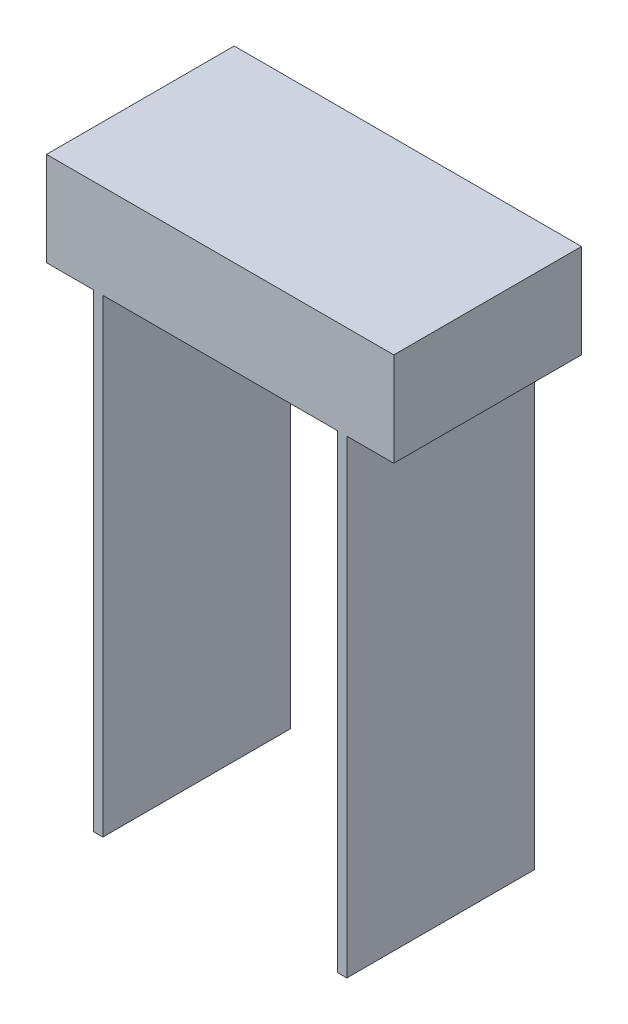
ISO-10303-21;
HEADER;
FILE_DESCRIPTION(('STEP AP214'),'2;1');
FILE_NAME('part.step','',(''),(''),'','','');
FILE_SCHEMA(('AUTOMOTIVE_DESIGN { 1 0 10303 214 1 1 1 1 }'));
ENDSEC;
DATA;
#1=APPLICATION_CONTEXT('core data for automotive mechanical design processes');
#2=APPLICATION_PROTOCOL_DEFINITION('international standard','automotive_design',2000,#1);
#3=PRODUCT_CONTEXT('',#1,'mechanical');
#4=PRODUCT('Part','Part','',(#3));
#5=PRODUCT_RELATED_PRODUCT_CATEGORY('part','',(#4));
#6=PRODUCT_DEFINITION_FORMATION('','',#4);
#7=PRODUCT_DEFINITION_CONTEXT('part definition',#1,'design');
#8=PRODUCT_DEFINITION('design','',#6,#7);
#9=PRODUCT_DEFINITION_SHAPE('','',#8);
#10=(LENGTH_UNIT() NAMED_UNIT(*) SI_UNIT(.MILLI.,.METRE.));
#11=(NAMED_UNIT(*) PLANE_ANGLE_UNIT() SI_UNIT($,.RADIAN.));
#12=(NAMED_UNIT(*) SI_UNIT($,.STERADIAN.) SOLID_ANGLE_UNIT());
#13=UNCERTAINTY_MEASURE_WITH_UNIT(LENGTH_MEASURE(1.E-05),#10,'distance_accuracy_value','');
#14=(GEOMETRIC_REPRESENTATION_CONTEXT(3) GLOBAL_UNCERTAINTY_ASSIGNED_CONTEXT((#13)) GLOBAL_UNIT_ASSIGNED_CONTEXT((#10,
#11,#12)) REPRESENTATION_CONTEXT('',''));
#15=CARTESIAN_POINT('',(0.,0.,0.));
#16=DIRECTION('',(0.,0.,1.));
#17=DIRECTION('',(1.,0.,0.));
#18=AXIS2_PLACEMENT_3D('',#15,#16,#17);
#19=CARTESIAN_POINT('',(-10.6233766233766,12.1298701298701,8.));
#20=DIRECTION('',(1.,0.,0.));
#21=DIRECTION('',(0.,0.,-1.));
#22=AXIS2_PLACEMENT_3D('',#19,#20,#21);
#23=PLANE('',#22);
#24=DIRECTION('',(0.,-1.,0.));
#25=VECTOR('',#24,1.);
#26=CARTESIAN_POINT('',(-10.6233766233766,12.1298701298701,0.));
#27=LINE('',#26,#25);
#28=CARTESIAN_POINT('',(-10.6233766233766,12.1298701298701,0.));
#29=VERTEX_POINT('',#28);
#30=CARTESIAN_POINT('',(-10.6233766233766,-7.87012987012987,0.));
#31=VERTEX_POINT('',#30);
#32=EDGE_CURVE('E156',#29,#31,#27,.T.);
#33=ORIENTED_EDGE('',*,*,#32,.T.);
#34=DIRECTION('',(0.,0.,-1.));
#35=VECTOR('',#34,1.);
#36=CARTESIAN_POINT('',(-10.6233766233766,-7.87012987012987,8.));
#37=LINE('',#36,#35);
#38=CARTESIAN_POINT('',(-10.6233766233766,-7.87012987012987,8.));
#39=VERTEX_POINT('',#38);
#40=EDGE_CURVE('E11',#39,#31,#37,.T.);
#41=ORIENTED_EDGE('',*,*,#40,.F.);
#42=DIRECTION('',(0.,-1.,0.));
#43=VECTOR('',#42,1.);
#44=CARTESIAN_POINT('',(-10.6233766233766,12.1298701298701,8.));
#45=LINE('',#44,#43);
#46=CARTESIAN_POINT('',(-10.6233766233766,12.1298701298701,8.));
#47=VERTEX_POINT('',#46);
#48=EDGE_CURVE('E178',#47,#39,#45,.T.);
#49=ORIENTED_EDGE('',*,*,#48,.F.);
#50=DIRECTION('',(0.,0.,-1.));
#51=VECTOR('',#50,1.);
#52=CARTESIAN_POINT('',(-10.6233766233766,12.1298701298701,8.));
#53=LINE('',#52,#51);
#54=EDGE_CURVE('E152',#47,#29,#53,.T.);
#55=ORIENTED_EDGE('',*,*,#54,.T.);
#56=EDGE_LOOP('',(#33,#41,#49,#55));
#57=FACE_BOUND('',#56,.T.);
#58=ADVANCED_FACE('F36',(#57),#23,.F.);
#59=CARTESIAN_POINT('',(-10.6233766233766,-7.87012987012987,8.));
#60=DIRECTION('',(0.,1.,0.));
#61=DIRECTION('',(0.,0.,1.));
#62=AXIS2_PLACEMENT_3D('',#59,#60,#61);
#63=PLANE('',#62);
#64=DIRECTION('',(1.,0.,0.));
#65=VECTOR('',#64,1.);
#66=CARTESIAN_POINT('',(-10.6233766233766,-7.87012987012987,0.));
#67=LINE('',#66,#65);
#68=CARTESIAN_POINT('',(-10.2233766233766,-7.87012987012987,0.));
#69=VERTEX_POINT('',#68);
#70=EDGE_CURVE('E159',#31,#69,#67,.T.);
#71=ORIENTED_EDGE('',*,*,#70,.T.);
#72=DIRECTION('',(0.,0.,-1.));
#73=VECTOR('',#72,1.);
#74=CARTESIAN_POINT('',(-10.2233766233766,-7.87012987012987,8.));
#75=LINE('',#74,#73);
#76=CARTESIAN_POINT('',(-10.2233766233766,-7.87012987012987,8.));
#77=VERTEX_POINT('',#76);
#78=EDGE_CURVE('E44',#77,#69,#75,.T.);
#79=ORIENTED_EDGE('',*,*,#78,.F.);
#80=DIRECTION('',(1.,0.,0.));
#81=VECTOR('',#80,1.);
#82=CARTESIAN_POINT('',(-10.6233766233766,-7.87012987012987,8.));
#83=LINE('',#82,#81);
#84=EDGE_CURVE('E107',#39,#77,#83,.T.);
#85=ORIENTED_EDGE('',*,*,#84,.F.);
#86=ORIENTED_EDGE('',*,*,#40,.T.);
#87=EDGE_LOOP('',(#71,#79,#85,#86));
#88=FACE_BOUND('',#87,.T.);
#89=ADVANCED_FACE('F256',(#88),#63,.F.);
#90=CARTESIAN_POINT('',(-10.2233766233766,-7.87012987012987,8.));
#91=DIRECTION('',(-1.,0.,0.));
#92=DIRECTION('',(0.,-1.,0.));
#93=AXIS2_PLACEMENT_3D('',#90,#91,#92);
#94=PLANE('',#93);
#95=DIRECTION('',(0.,1.,0.));
#96=VECTOR('',#95,1.);
#97=CARTESIAN_POINT('',(-10.2233766233766,-7.87012987012987,0.));
#98=LINE('',#97,#96);
#99=CARTESIAN_POINT('',(-10.2233766233766,12.1298701298701,0.));
#100=VERTEX_POINT('',#99);
#101=EDGE_CURVE('E161',#69,#100,#98,.T.);
#102=ORIENTED_EDGE('',*,*,#101,.T.);
#103=DIRECTION('',(0.,0.,-1.));
#104=VECTOR('',#103,1.);
#105=CARTESIAN_POINT('',(-10.2233766233766,12.1298701298701,8.));
#106=LINE('',#105,#104);
#107=CARTESIAN_POINT('',(-10.2233766233766,12.1298701298701,8.));
#108=VERTEX_POINT('',#107);
#109=EDGE_CURVE('E197',#108,#100,#106,.T.);
#110=ORIENTED_EDGE('',*,*,#109,.F.);
#111=DIRECTION('',(0.,1.,0.));
#112=VECTOR('',#111,1.);
#113=CARTESIAN_POINT('',(-10.2233766233766,-7.87012987012987,8.));
#114=LINE('',#113,#112);
#115=EDGE_CURVE('E205',#77,#108,#114,.T.);
#116=ORIENTED_EDGE('',*,*,#115,.F.);
#117=ORIENTED_EDGE('',*,*,#78,.T.);
#118=EDGE_LOOP('',(#102,#110,#116,#117));
#119=FACE_BOUND('',#118,.T.);
#120=ADVANCED_FACE('F203',(#119),#94,.F.);
#121=CARTESIAN_POINT('',(-10.2233766233766,12.1298701298701,8.));
#122=DIRECTION('',(0.,1.,0.));
#123=DIRECTION('',(0.,0.,1.));
#124=AXIS2_PLACEMENT_3D('',#121,#122,#123);
#125=PLANE('',#124);
#126=DIRECTION('',(1.,0.,0.));
#127=VECTOR('',#126,1.);
#128=CARTESIAN_POINT('',(-10.2233766233766,12.1298701298701,0.));
#129=LINE('',#128,#127);
#130=CARTESIAN_POINT('',(-0.223376623376622,12.1298701298701,0.));
#131=VERTEX_POINT('',#130);
#132=EDGE_CURVE('E163',#100,#131,#129,.T.);
#133=ORIENTED_EDGE('',*,*,#132,.T.);
#134=DIRECTION('',(0.,0.,-1.));
#135=VECTOR('',#134,1.);
#136=CARTESIAN_POINT('',(-0.223376623376622,12.1298701298701,8.));
#137=LINE('',#136,#135);
#138=CARTESIAN_POINT('',(-0.223376623376622,12.1298701298701,8.));
#139=VERTEX_POINT('',#138);
#140=EDGE_CURVE('E194',#139,#131,#137,.T.);
#141=ORIENTED_EDGE('',*,*,#140,.F.);
#142=DIRECTION('',(1.,0.,0.));
#143=VECTOR('',#142,1.);
#144=CARTESIAN_POINT('',(-10.2233766233766,12.1298701298701,8.));
#145=LINE('',#144,#143);
#146=EDGE_CURVE('E223',#108,#139,#145,.T.);
#147=ORIENTED_EDGE('',*,*,#146,.F.);
#148=ORIENTED_EDGE('',*,*,#109,.T.);
#149=EDGE_LOOP('',(#133,#141,#147,#148));
#150=FACE_BOUND('',#149,.T.);
#151=ADVANCED_FACE('F214',(#150),#125,.F.);
#152=CARTESIAN_POINT('',(-0.223376623376622,12.1298701298701,8.));
#153=DIRECTION('',(1.,0.,0.));
#154=DIRECTION('',(0.,1.,0.));
#155=AXIS2_PLACEMENT_3D('',#152,#153,#154);
#156=PLANE('',#155);
#157=DIRECTION('',(0.,-1.,0.));
#158=VECTOR('',#157,1.);
#159=CARTESIAN_POINT('',(-0.223376623376622,12.1298701298701,0.));
#160=LINE('',#159,#158);
#161=CARTESIAN_POINT('',(-0.22337662337662,-7.87012987012987,0.));
#162=VERTEX_POINT('',#161);
#163=EDGE_CURVE('E165',#131,#162,#160,.T.);
#164=ORIENTED_EDGE('',*,*,#163,.T.);
#165=DIRECTION('',(0.,0.,-1.));
#166=VECTOR('',#165,1.);
#167=CARTESIAN_POINT('',(-0.22337662337662,-7.87012987012987,8.));
#168=LINE('',#167,#166);
#169=CARTESIAN_POINT('',(-0.22337662337662,-7.87012987012987,8.));
#170=VERTEX_POINT('',#169);
#171=EDGE_CURVE('E191',#170,#162,#168,.T.);
#172=ORIENTED_EDGE('',*,*,#171,.F.);
#173=DIRECTION('',(0.,-1.,0.));
#174=VECTOR('',#173,1.);
#175=CARTESIAN_POINT('',(-0.223376623376622,12.1298701298701,8.));
#176=LINE('',#175,#174);
#177=EDGE_CURVE('E220',#139,#170,#176,.T.);
#178=ORIENTED_EDGE('',*,*,#177,.F.);
#179=ORIENTED_EDGE('',*,*,#140,.T.);
#180=EDGE_LOOP('',(#164,#172,#178,#179));
#181=FACE_BOUND('',#180,.T.);
#182=ADVANCED_FACE('F218',(#181),#156,.F.);
#183=CARTESIAN_POINT('',(-0.22337662337662,-7.87012987012987,8.));
#184=DIRECTION('',(0.,1.,0.));
#185=DIRECTION('',(0.,0.,1.));
#186=AXIS2_PLACEMENT_3D('',#183,#184,#185);
#187=PLANE('',#186);
#188=DIRECTION('',(1.,0.,0.));
#189=VECTOR('',#188,1.);
#190=CARTESIAN_POINT('',(-0.22337662337662,-7.87012987012987,0.));
#191=LINE('',#190,#189);
#192=CARTESIAN_POINT('',(0.17662337662338,-7.87012987012987,0.));
#193=VERTEX_POINT('',#192);
#194=EDGE_CURVE('E167',#162,#193,#191,.T.);
#195=ORIENTED_EDGE('',*,*,#194,.T.);
#196=DIRECTION('',(0.,0.,-1.));
#197=VECTOR('',#196,1.);
#198=CARTESIAN_POINT('',(0.17662337662338,-7.87012987012987,8.));
#199=LINE('',#198,#197);
#200=CARTESIAN_POINT('',(0.17662337662338,-7.87012987012987,8.));
#201=VERTEX_POINT('',#200);
#202=EDGE_CURVE('E188',#201,#193,#199,.T.);
#203=ORIENTED_EDGE('',*,*,#202,.F.);
#204=DIRECTION('',(1.,0.,0.));
#205=VECTOR('',#204,1.);
#206=CARTESIAN_POINT('',(-0.22337662337662,-7.87012987012987,8.));
#207=LINE('',#206,#205);
#208=EDGE_CURVE('E222',#170,#201,#207,.T.);
#209=ORIENTED_EDGE('',*,*,#208,.F.);
#210=ORIENTED_EDGE('',*,*,#171,.T.);
#211=EDGE_LOOP('',(#195,#203,#209,#210));
#212=FACE_BOUND('',#211,.T.);
#213=ADVANCED_FACE('F269',(#212),#187,.F.);
#214=CARTESIAN_POINT('',(0.17662337662338,-7.87012987012987,8.));
#215=DIRECTION('',(-1.,0.,0.));
#216=DIRECTION('',(0.,0.,1.));
#217=AXIS2_PLACEMENT_3D('',#214,#215,#216);
#218=PLANE('',#217);
#219=DIRECTION('',(0.,1.,0.));
#220=VECTOR('',#219,1.);
#221=CARTESIAN_POINT('',(0.17662337662338,-7.87012987012987,0.));
#222=LINE('',#221,#220);
#223=CARTESIAN_POINT('',(0.17662337662338,12.1298701298701,0.));
#224=VERTEX_POINT('',#223);
#225=EDGE_CURVE('E169',#193,#224,#222,.T.);
#226=ORIENTED_EDGE('',*,*,#225,.T.);
#227=DIRECTION('',(0.,0.,-1.));
#228=VECTOR('',#227,1.);
#229=CARTESIAN_POINT('',(0.17662337662338,12.1298701298701,8.));
#230=LINE('',#229,#228);
#231=CARTESIAN_POINT('',(0.17662337662338,12.1298701298701,8.));
#232=VERTEX_POINT('',#231);
#233=EDGE_CURVE('E185',#232,#224,#230,.T.);
#234=ORIENTED_EDGE('',*,*,#233,.F.);
#235=DIRECTION('',(0.,1.,0.));
#236=VECTOR('',#235,1.);
#237=CARTESIAN_POINT('',(0.17662337662338,-7.87012987012987,8.));
#238=LINE('',#237,#236);
#239=EDGE_CURVE('E225',#201,#232,#238,.T.);
#240=ORIENTED_EDGE('',*,*,#239,.F.);
#241=ORIENTED_EDGE('',*,*,#202,.T.);
#242=EDGE_LOOP('',(#226,#234,#240,#241));
#243=FACE_BOUND('',#242,.T.);
#244=ADVANCED_FACE('F272',(#243),#218,.F.);
#245=CARTESIAN_POINT('',(0.17662337662338,12.1298701298701,8.));
#246=DIRECTION('',(0.,1.,0.));
#247=DIRECTION('',(0.,0.,1.));
#248=AXIS2_PLACEMENT_3D('',#245,#246,#247);
#249=PLANE('',#248);
#250=DIRECTION('',(1.,0.,0.));
#251=VECTOR('',#250,1.);
#252=CARTESIAN_POINT('',(0.17662337662338,12.1298701298701,0.));
#253=LINE('',#252,#251);
#254=CARTESIAN_POINT('',(2.17662337662338,12.1298701298701,0.));
#255=VERTEX_POINT('',#254);
#256=EDGE_CURVE('E171',#224,#255,#253,.T.);
#257=ORIENTED_EDGE('',*,*,#256,.T.);
#258=DIRECTION('',(0.,0.,-1.));
#259=VECTOR('',#258,1.);
#260=CARTESIAN_POINT('',(2.17662337662338,12.1298701298701,8.));
#261=LINE('',#260,#259);
#262=CARTESIAN_POINT('',(2.17662337662338,12.1298701298701,8.));
#263=VERTEX_POINT('',#262);
#264=EDGE_CURVE('E182',#263,#255,#261,.T.);
#265=ORIENTED_EDGE('',*,*,#264,.F.);
#266=DIRECTION('',(1.,0.,0.));
#267=VECTOR('',#266,1.);
#268=CARTESIAN_POINT('',(0.17662337662338,12.1298701298701,8.));
#269=LINE('',#268,#267);
#270=EDGE_CURVE('E231',#232,#263,#269,.T.);
#271=ORIENTED_EDGE('',*,*,#270,.F.);
#272=ORIENTED_EDGE('',*,*,#233,.T.);
#273=EDGE_LOOP('',(#257,#265,#271,#272));
#274=FACE_BOUND('',#273,.T.);
#275=ADVANCED_FACE('F237',(#274),#249,.F.);
#276=CARTESIAN_POINT('',(2.17662337662338,12.1298701298701,8.));
#277=DIRECTION('',(-1.,0.,0.));
#278=DIRECTION('',(0.,0.,1.));
#279=AXIS2_PLACEMENT_3D('',#276,#277,#278);
#280=PLANE('',#279);
#281=DIRECTION('',(0.,1.,0.));
#282=VECTOR('',#281,1.);
#283=CARTESIAN_POINT('',(2.17662337662338,12.1298701298701,0.));
#284=LINE('',#283,#282);
#285=CARTESIAN_POINT('',(2.17662337662338,16.1298701298701,0.));
#286=VERTEX_POINT('',#285);
#287=EDGE_CURVE('E173',#255,#286,#284,.T.);
#288=ORIENTED_EDGE('',*,*,#287,.T.);
#289=DIRECTION('',(0.,0.,-1.));
#290=VECTOR('',#289,1.);
#291=CARTESIAN_POINT('',(2.17662337662338,16.1298701298701,8.));
#292=LINE('',#291,#290);
#293=CARTESIAN_POINT('',(2.17662337662338,16.1298701298701,8.));
#294=VERTEX_POINT('',#293);
#295=EDGE_CURVE('E147',#294,#286,#292,.T.);
#296=ORIENTED_EDGE('',*,*,#295,.F.);
#297=DIRECTION('',(0.,1.,0.));
#298=VECTOR('',#297,1.);
#299=CARTESIAN_POINT('',(2.17662337662338,12.1298701298701,8.));
#300=LINE('',#299,#298);
#301=EDGE_CURVE('E138',#263,#294,#300,.T.);
#302=ORIENTED_EDGE('',*,*,#301,.F.);
#303=ORIENTED_EDGE('',*,*,#264,.T.);
#304=EDGE_LOOP('',(#288,#296,#302,#303));
#305=FACE_BOUND('',#304,.T.);
#306=ADVANCED_FACE('F241',(#305),#280,.F.);
#307=CARTESIAN_POINT('',(2.17662337662338,16.1298701298701,8.));
#308=DIRECTION('',(0.,-1.,0.));
#309=DIRECTION('',(1.,0.,0.));
#310=AXIS2_PLACEMENT_3D('',#307,#308,#309);
#311=PLANE('',#310);
#312=DIRECTION('',(-1.,0.,0.));
#313=VECTOR('',#312,1.);
#314=CARTESIAN_POINT('',(2.17662337662338,16.1298701298701,0.));
#315=LINE('',#314,#313);
#316=CARTESIAN_POINT('',(-12.6233766233766,16.1298701298701,0.));
#317=VERTEX_POINT('',#316);
#318=EDGE_CURVE('E146',#286,#317,#315,.T.);
#319=ORIENTED_EDGE('',*,*,#318,.T.);
#320=DIRECTION('',(0.,0.,-1.));
#321=VECTOR('',#320,1.);
#322=CARTESIAN_POINT('',(-12.6233766233766,16.1298701298701,8.));
#323=LINE('',#322,#321);
#324=CARTESIAN_POINT('',(-12.6233766233766,16.1298701298701,8.));
#325=VERTEX_POINT('',#324);
#326=EDGE_CURVE('E143',#325,#317,#323,.T.);
#327=ORIENTED_EDGE('',*,*,#326,.F.);
#328=DIRECTION('',(-1.,0.,0.));
#329=VECTOR('',#328,1.);
#330=CARTESIAN_POINT('',(2.17662337662338,16.1298701298701,8.));
#331=LINE('',#330,#329);
#332=EDGE_CURVE('E132',#294,#325,#331,.T.);
#333=ORIENTED_EDGE('',*,*,#332,.F.);
#334=ORIENTED_EDGE('',*,*,#295,.T.);
#335=EDGE_LOOP('',(#319,#327,#333,#334));
#336=FACE_BOUND('',#335,.T.);
#337=ADVANCED_FACE('F144',(#336),#311,.F.);
#338=CARTESIAN_POINT('',(-12.6233766233766,16.1298701298701,8.));
#339=DIRECTION('',(1.,0.,0.));
#340=DIRECTION('',(0.,0.,-1.));
#341=AXIS2_PLACEMENT_3D('',#338,#339,#340);
#342=PLANE('',#341);
#343=DIRECTION('',(0.,-1.,0.));
#344=VECTOR('',#343,1.);
#345=CARTESIAN_POINT('',(-12.6233766233766,16.1298701298701,0.));
#346=LINE('',#345,#344);
#347=CARTESIAN_POINT('',(-12.6233766233766,12.1298701298701,0.));
#348=VERTEX_POINT('',#347);
#349=EDGE_CURVE('E93',#317,#348,#346,.T.);
#350=ORIENTED_EDGE('',*,*,#349,.T.);
#351=DIRECTION('',(0.,0.,-1.));
#352=VECTOR('',#351,1.);
#353=CARTESIAN_POINT('',(-12.6233766233766,12.1298701298701,8.));
#354=LINE('',#353,#352);
#355=CARTESIAN_POINT('',(-12.6233766233766,12.1298701298701,8.));
#356=VERTEX_POINT('',#355);
#357=EDGE_CURVE('E148',#356,#348,#354,.T.);
#358=ORIENTED_EDGE('',*,*,#357,.F.);
#359=DIRECTION('',(0.,-1.,0.));
#360=VECTOR('',#359,1.);
#361=CARTESIAN_POINT('',(-12.6233766233766,16.1298701298701,8.));
#362=LINE('',#361,#360);
#363=EDGE_CURVE('E136',#325,#356,#362,.T.);
#364=ORIENTED_EDGE('',*,*,#363,.F.);
#365=ORIENTED_EDGE('',*,*,#326,.T.);
#366=EDGE_LOOP('',(#350,#358,#364,#365));
#367=FACE_BOUND('',#366,.T.);
#368=ADVANCED_FACE('F150',(#367),#342,.F.);
#369=CARTESIAN_POINT('',(-12.6233766233766,12.1298701298701,8.));
#370=DIRECTION('',(0.,1.,0.));
#371=DIRECTION('',(0.,0.,1.));
#372=AXIS2_PLACEMENT_3D('',#369,#370,#371);
#373=PLANE('',#372);
#374=DIRECTION('',(1.,0.,0.));
#375=VECTOR('',#374,1.);
#376=CARTESIAN_POINT('',(-12.6233766233766,12.1298701298701,0.));
#377=LINE('',#376,#375);
#378=EDGE_CURVE('E99',#348,#29,#377,.T.);
#379=ORIENTED_EDGE('',*,*,#378,.T.);
#380=ORIENTED_EDGE('',*,*,#54,.F.);
#381=DIRECTION('',(1.,0.,0.));
#382=VECTOR('',#381,1.);
#383=CARTESIAN_POINT('',(-12.6233766233766,12.1298701298701,8.));
#384=LINE('',#383,#382);
#385=EDGE_CURVE('E52',#356,#47,#384,.T.);
#386=ORIENTED_EDGE('',*,*,#385,.F.);
#387=ORIENTED_EDGE('',*,*,#357,.T.);
#388=EDGE_LOOP('',(#379,#380,#386,#387));
#389=FACE_BOUND('',#388,.T.);
#390=ADVANCED_FACE('F245',(#389),#373,.F.);
#391=CARTESIAN_POINT('',(0.,0.,8.));
#392=DIRECTION('',(0.,0.,1.));
#393=DIRECTION('',(1.,0.,0.));
#394=AXIS2_PLACEMENT_3D('',#391,#392,#393);
#395=PLANE('',#394);
#396=ORIENTED_EDGE('',*,*,#48,.T.);
#397=ORIENTED_EDGE('',*,*,#84,.T.);
#398=ORIENTED_EDGE('',*,*,#115,.T.);
#399=ORIENTED_EDGE('',*,*,#146,.T.);
#400=ORIENTED_EDGE('',*,*,#177,.T.);
#401=ORIENTED_EDGE('',*,*,#208,.T.);
#402=ORIENTED_EDGE('',*,*,#239,.T.);
#403=ORIENTED_EDGE('',*,*,#270,.T.);
#404=ORIENTED_EDGE('',*,*,#301,.T.);
#405=ORIENTED_EDGE('',*,*,#332,.T.);
#406=ORIENTED_EDGE('',*,*,#363,.T.);
#407=ORIENTED_EDGE('',*,*,#385,.T.);
#408=EDGE_LOOP('',(#396,#397,#398,#399,#400,#401,#402,#403,#404,#405,#406,#407));
#409=FACE_BOUND('',#408,.T.);
#410=ADVANCED_FACE('F134',(#409),#395,.T.);
#411=CARTESIAN_POINT('',(0.,0.,0.));
#412=DIRECTION('',(0.,0.,1.));
#413=DIRECTION('',(1.,0.,0.));
#414=AXIS2_PLACEMENT_3D('',#411,#412,#413);
#415=PLANE('',#414);
#416=ORIENTED_EDGE('',*,*,#32,.F.);
#417=ORIENTED_EDGE('',*,*,#378,.F.);
#418=ORIENTED_EDGE('',*,*,#349,.F.);
#419=ORIENTED_EDGE('',*,*,#318,.F.);
#420=ORIENTED_EDGE('',*,*,#287,.F.);
#421=ORIENTED_EDGE('',*,*,#256,.F.);
#422=ORIENTED_EDGE('',*,*,#225,.F.);
#423=ORIENTED_EDGE('',*,*,#194,.F.);
#424=ORIENTED_EDGE('',*,*,#163,.F.);
#425=ORIENTED_EDGE('',*,*,#132,.F.);
#426=ORIENTED_EDGE('',*,*,#101,.F.);
#427=ORIENTED_EDGE('',*,*,#70,.F.);
#428=EDGE_LOOP('',(#416,#417,#418,#419,#420,#421,#422,#423,#424,#425,#426,#427));
#429=FACE_BOUND('',#428,.T.);
#430=ADVANCED_FACE('F209',(#429),#415,.F.);
#431=CLOSED_SHELL('',(#58,#89,#120,#151,#182,#213,#244,#275,#306,#337,#368,#390,#410,#430));
#432=MANIFOLD_SOLID_BREP('B2',#431);
#433=ADVANCED_BREP_SHAPE_REPRESENTATION('',(#18,#432),#14);
#434=SHAPE_DEFINITION_REPRESENTATION(#9,#433);
ENDSEC;
END-ISO-10303-21;
